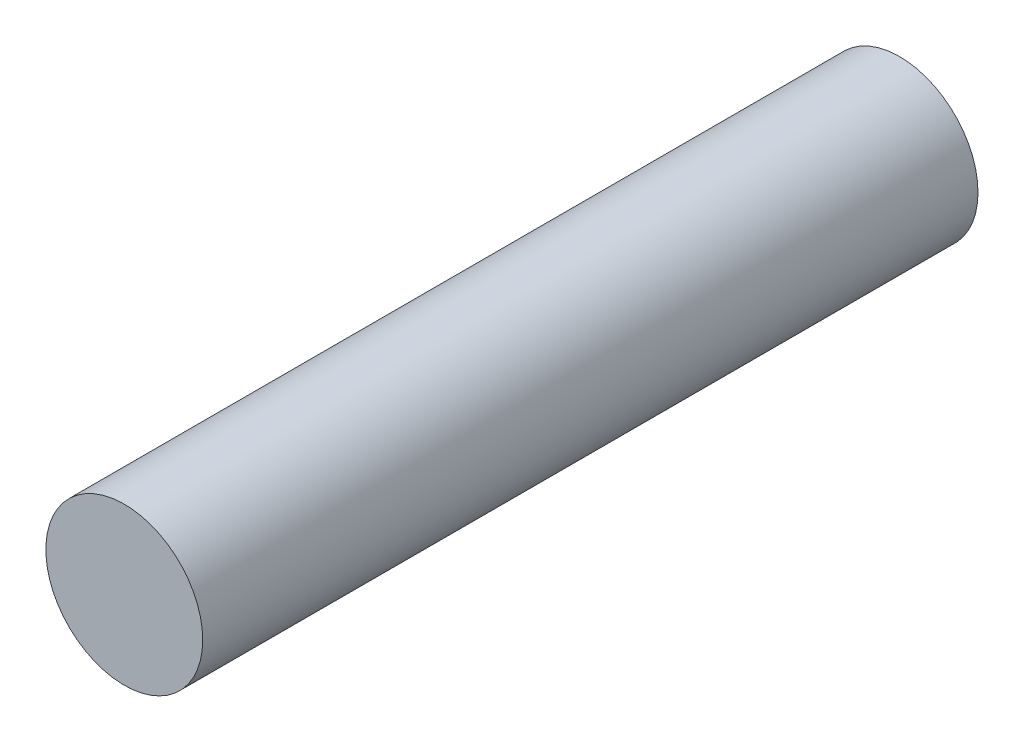
ISO-10303-21;
HEADER;
FILE_DESCRIPTION(('STEP AP214'),'2;1');
FILE_NAME('part.step','',(''),(''),'','','');
FILE_SCHEMA(('AUTOMOTIVE_DESIGN { 1 0 10303 214 1 1 1 1 }'));
ENDSEC;
DATA;
#1=APPLICATION_CONTEXT('core data for automotive mechanical design processes');
#2=APPLICATION_PROTOCOL_DEFINITION('international standard','automotive_design',2000,#1);
#3=PRODUCT_CONTEXT('',#1,'mechanical');
#4=PRODUCT('Part','Part','',(#3));
#5=PRODUCT_RELATED_PRODUCT_CATEGORY('part','',(#4));
#6=PRODUCT_DEFINITION_FORMATION('','',#4);
#7=PRODUCT_DEFINITION_CONTEXT('part definition',#1,'design');
#8=PRODUCT_DEFINITION('design','',#6,#7);
#9=PRODUCT_DEFINITION_SHAPE('','',#8);
#10=(LENGTH_UNIT() NAMED_UNIT(*) SI_UNIT(.MILLI.,.METRE.));
#11=(NAMED_UNIT(*) PLANE_ANGLE_UNIT() SI_UNIT($,.RADIAN.));
#12=(NAMED_UNIT(*) SI_UNIT($,.STERADIAN.) SOLID_ANGLE_UNIT());
#13=UNCERTAINTY_MEASURE_WITH_UNIT(LENGTH_MEASURE(1.E-05),#10,'distance_accuracy_value','');
#14=(GEOMETRIC_REPRESENTATION_CONTEXT(3) GLOBAL_UNCERTAINTY_ASSIGNED_CONTEXT((#13)) GLOBAL_UNIT_ASSIGNED_CONTEXT((#10,
#11,#12)) REPRESENTATION_CONTEXT('',''));
#15=CARTESIAN_POINT('',(0.,0.,0.));
#16=DIRECTION('',(0.,0.,1.));
#17=DIRECTION('',(1.,0.,0.));
#18=AXIS2_PLACEMENT_3D('',#15,#16,#17);
#19=CARTESIAN_POINT('',(0.,0.,32.639));
#20=DIRECTION('',(0.,0.,-1.));
#21=DIRECTION('',(-1.,0.,0.));
#22=AXIS2_PLACEMENT_3D('',#19,#20,#21);
#23=CYLINDRICAL_SURFACE('',#22,3.302);
#24=CARTESIAN_POINT('',(0.,0.,32.639));
#25=DIRECTION('',(0.,0.,1.));
#26=DIRECTION('',(1.,0.,0.));
#27=AXIS2_PLACEMENT_3D('',#24,#25,#26);
#28=CIRCLE('',#27,3.302);
#29=CARTESIAN_POINT('',(3.302,0.,32.639));
#30=VERTEX_POINT('',#29);
#31=EDGE_CURVE('E10',#30,#30,#28,.T.);
#32=ORIENTED_EDGE('',*,*,#31,.F.);
#33=EDGE_LOOP('',(#32));
#34=FACE_BOUND('',#33,.T.);
#35=CARTESIAN_POINT('',(0.,0.,0.));
#36=DIRECTION('',(0.,0.,1.));
#37=DIRECTION('',(1.,0.,0.));
#38=AXIS2_PLACEMENT_3D('',#35,#36,#37);
#39=CIRCLE('',#38,3.302);
#40=CARTESIAN_POINT('',(3.302,0.,0.));
#41=VERTEX_POINT('',#40);
#42=EDGE_CURVE('E33',#41,#41,#39,.T.);
#43=ORIENTED_EDGE('',*,*,#42,.T.);
#44=EDGE_LOOP('',(#43));
#45=FACE_BOUND('',#44,.T.);
#46=ADVANCED_FACE('F30',(#34,#45),#23,.T.);
#47=CARTESIAN_POINT('',(0.,0.,32.639));
#48=DIRECTION('',(0.,0.,1.));
#49=DIRECTION('',(1.,0.,0.));
#50=AXIS2_PLACEMENT_3D('',#47,#48,#49);
#51=PLANE('',#50);
#52=ORIENTED_EDGE('',*,*,#31,.T.);
#53=EDGE_LOOP('',(#52));
#54=FACE_BOUND('',#53,.T.);
#55=ADVANCED_FACE('F45',(#54),#51,.T.);
#56=CARTESIAN_POINT('',(0.,0.,0.));
#57=DIRECTION('',(0.,0.,1.));
#58=DIRECTION('',(1.,0.,0.));
#59=AXIS2_PLACEMENT_3D('',#56,#57,#58);
#60=PLANE('',#59);
#61=ORIENTED_EDGE('',*,*,#42,.F.);
#62=EDGE_LOOP('',(#61));
#63=FACE_BOUND('',#62,.T.);
#64=ADVANCED_FACE('F43',(#63),#60,.F.);
#65=CLOSED_SHELL('',(#46,#55,#64));
#66=MANIFOLD_SOLID_BREP('B2',#65);
#67=ADVANCED_BREP_SHAPE_REPRESENTATION('',(#18,#66),#14);
#68=SHAPE_DEFINITION_REPRESENTATION(#9,#67);
ENDSEC;
END-ISO-10303-21;
